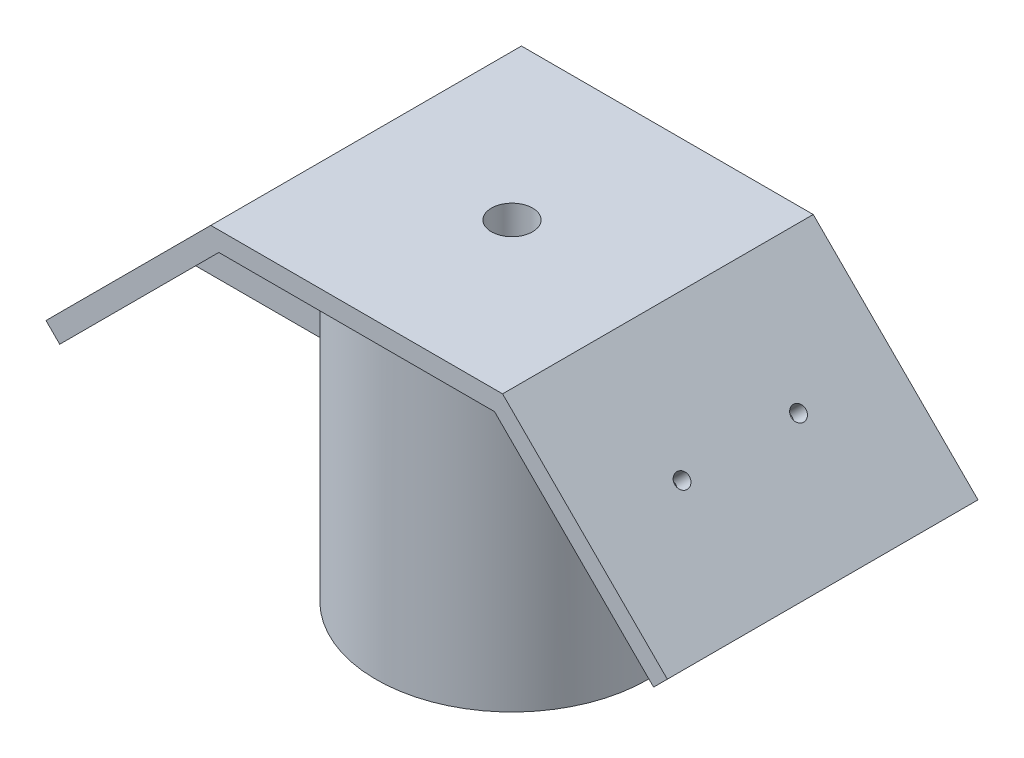
ISO-10303-21;
HEADER;
FILE_DESCRIPTION(('STEP AP214'),'2;1');
FILE_NAME('part.step','',(''),(''),'','','');
FILE_SCHEMA(('AUTOMOTIVE_DESIGN { 1 0 10303 214 1 1 1 1 }'));
ENDSEC;
DATA;
#1=APPLICATION_CONTEXT('core data for automotive mechanical design processes');
#2=APPLICATION_PROTOCOL_DEFINITION('international standard','automotive_design',2000,#1);
#3=PRODUCT_CONTEXT('',#1,'mechanical');
#4=PRODUCT('Part','Part','',(#3));
#5=PRODUCT_RELATED_PRODUCT_CATEGORY('part','',(#4));
#6=PRODUCT_DEFINITION_FORMATION('','',#4);
#7=PRODUCT_DEFINITION_CONTEXT('part definition',#1,'design');
#8=PRODUCT_DEFINITION('design','',#6,#7);
#9=PRODUCT_DEFINITION_SHAPE('','',#8);
#10=(LENGTH_UNIT() NAMED_UNIT(*) SI_UNIT(.MILLI.,.METRE.));
#11=(NAMED_UNIT(*) PLANE_ANGLE_UNIT() SI_UNIT($,.RADIAN.));
#12=(NAMED_UNIT(*) SI_UNIT($,.STERADIAN.) SOLID_ANGLE_UNIT());
#13=UNCERTAINTY_MEASURE_WITH_UNIT(LENGTH_MEASURE(1.E-05),#10,'distance_accuracy_value','');
#14=(GEOMETRIC_REPRESENTATION_CONTEXT(3) GLOBAL_UNCERTAINTY_ASSIGNED_CONTEXT((#13)) GLOBAL_UNIT_ASSIGNED_CONTEXT((#10,
#11,#12)) REPRESENTATION_CONTEXT('',''));
#15=CARTESIAN_POINT('',(0.,0.,0.));
#16=DIRECTION('',(0.,0.,1.));
#17=DIRECTION('',(1.,0.,0.));
#18=AXIS2_PLACEMENT_3D('',#15,#16,#17);
#19=CARTESIAN_POINT('',(0.,38.325640302673,50.8));
#20=DIRECTION('',(0.,-1.,0.));
#21=DIRECTION('',(1.,0.,0.));
#22=AXIS2_PLACEMENT_3D('',#19,#20,#21);
#23=PLANE('',#22);
#24=DIRECTION('',(0.,0.,-1.));
#25=VECTOR('',#24,1.);
#26=CARTESIAN_POINT('',(22.5441035762581,38.3256403026731,50.8));
#27=LINE('',#26,#25);
#28=CARTESIAN_POINT('',(22.5441035762581,38.3256403026731,22.225));
#29=VERTEX_POINT('',#28);
#30=CARTESIAN_POINT('',(22.5441035762581,38.3256403026731,0.));
#31=VERTEX_POINT('',#30);
#32=EDGE_CURVE('E262',#29,#31,#27,.T.);
#33=ORIENTED_EDGE('',*,*,#32,.F.);
#34=DIRECTION('',(1.,0.,0.));
#35=VECTOR('',#34,1.);
#36=CARTESIAN_POINT('',(-500000.,38.3256403023652,22.225));
#37=LINE('',#36,#35);
#38=CARTESIAN_POINT('',(21.9970452561247,38.3256403026731,22.225));
#39=VERTEX_POINT('',#38);
#40=EDGE_CURVE('E182',#39,#29,#37,.T.);
#41=ORIENTED_EDGE('',*,*,#40,.F.);
#42=CARTESIAN_POINT('',(0.,38.3256403026731,25.4));
#43=DIRECTION('',(0.,-1.,0.));
#44=DIRECTION('',(1.,0.,0.));
#45=AXIS2_PLACEMENT_3D('',#42,#43,#44);
#46=CIRCLE('',#45,22.225);
#47=CARTESIAN_POINT('',(-21.9970452561248,38.3256403026731,22.225));
#48=VERTEX_POINT('',#47);
#49=EDGE_CURVE('E11',#48,#39,#46,.T.);
#50=ORIENTED_EDGE('',*,*,#49,.F.);
#51=DIRECTION('',(-1.,0.,0.));
#52=VECTOR('',#51,1.);
#53=CARTESIAN_POINT('',(500000.,38.325640302673,22.225));
#54=LINE('',#53,#52);
#55=CARTESIAN_POINT('',(-22.5441035762581,38.325640302673,22.225));
#56=VERTEX_POINT('',#55);
#57=EDGE_CURVE('E205',#48,#56,#54,.T.);
#58=ORIENTED_EDGE('',*,*,#57,.T.);
#59=DIRECTION('',(0.,0.,-1.));
#60=VECTOR('',#59,1.);
#61=CARTESIAN_POINT('',(-22.5441035762581,38.325640302673,50.8));
#62=LINE('',#61,#60);
#63=CARTESIAN_POINT('',(-22.5441035762581,38.325640302673,0.));
#64=VERTEX_POINT('',#63);
#65=EDGE_CURVE('E266',#56,#64,#62,.T.);
#66=ORIENTED_EDGE('',*,*,#65,.T.);
#67=DIRECTION('',(-1.,0.,0.));
#68=VECTOR('',#67,1.);
#69=CARTESIAN_POINT('',(0.,38.325640302673,0.));
#70=LINE('',#69,#68);
#71=EDGE_CURVE('E254',#31,#64,#70,.T.);
#72=ORIENTED_EDGE('',*,*,#71,.F.);
#73=EDGE_LOOP('',(#33,#41,#50,#58,#66,#72));
#74=FACE_BOUND('',#73,.T.);
#75=ADVANCED_FACE('F37',(#74),#23,.T.);
#76=CARTESIAN_POINT('',(21.9970452561247,38.3256403026731,28.575));
#77=VERTEX_POINT('',#76);
#78=CARTESIAN_POINT('',(-21.9970452561247,38.3256403026731,28.575));
#79=VERTEX_POINT('',#78);
#80=EDGE_CURVE('E45',#77,#79,#46,.T.);
#81=ORIENTED_EDGE('',*,*,#80,.F.);
#82=DIRECTION('',(1.,0.,0.));
#83=VECTOR('',#82,1.);
#84=CARTESIAN_POINT('',(-500000.,38.3256403023652,28.575));
#85=LINE('',#84,#83);
#86=CARTESIAN_POINT('',(22.5441035762581,38.3256403026731,28.575));
#87=VERTEX_POINT('',#86);
#88=EDGE_CURVE('E185',#77,#87,#85,.T.);
#89=ORIENTED_EDGE('',*,*,#88,.T.);
#90=CARTESIAN_POINT('',(22.5441035762581,38.3256403026731,50.8));
#91=VERTEX_POINT('',#90);
#92=EDGE_CURVE('E263',#91,#87,#27,.T.);
#93=ORIENTED_EDGE('',*,*,#92,.F.);
#94=DIRECTION('',(-1.,0.,0.));
#95=VECTOR('',#94,1.);
#96=CARTESIAN_POINT('',(0.,38.325640302673,50.8));
#97=LINE('',#96,#95);
#98=CARTESIAN_POINT('',(-22.5441035762581,38.325640302673,50.8));
#99=VERTEX_POINT('',#98);
#100=EDGE_CURVE('E231',#91,#99,#97,.T.);
#101=ORIENTED_EDGE('',*,*,#100,.T.);
#102=CARTESIAN_POINT('',(-22.5441035762581,38.325640302673,28.575));
#103=VERTEX_POINT('',#102);
#104=EDGE_CURVE('E267',#99,#103,#62,.T.);
#105=ORIENTED_EDGE('',*,*,#104,.T.);
#106=DIRECTION('',(-1.,0.,0.));
#107=VECTOR('',#106,1.);
#108=CARTESIAN_POINT('',(500000.,38.325640302673,28.575));
#109=LINE('',#108,#107);
#110=EDGE_CURVE('E203',#79,#103,#109,.T.);
#111=ORIENTED_EDGE('',*,*,#110,.F.);
#112=EDGE_LOOP('',(#81,#89,#93,#101,#105,#111));
#113=FACE_BOUND('',#112,.T.);
#114=ADVANCED_FACE('F292',(#113),#23,.T.);
#115=CARTESIAN_POINT('',(0.,101.187433150157,25.4));
#116=DIRECTION('',(0.,-1.,0.));
#117=DIRECTION('',(1.,0.,0.));
#118=AXIS2_PLACEMENT_3D('',#115,#116,#117);
#119=CYLINDRICAL_SURFACE('',#118,22.225);
#120=CARTESIAN_POINT('',(0.,-12.474359697327,25.4));
#121=DIRECTION('',(0.,-1.,0.));
#122=DIRECTION('',(1.,0.,0.));
#123=AXIS2_PLACEMENT_3D('',#120,#121,#122);
#124=CIRCLE('',#123,22.225);
#125=CARTESIAN_POINT('',(22.225,-12.4743596973269,25.4));
#126=VERTEX_POINT('',#125);
#127=EDGE_CURVE('E198',#126,#126,#124,.T.);
#128=ORIENTED_EDGE('',*,*,#127,.F.);
#129=EDGE_LOOP('',(#128));
#130=FACE_BOUND('',#129,.T.);
#131=ORIENTED_EDGE('',*,*,#49,.T.);
#132=DIRECTION('',(0.,-1.,0.));
#133=VECTOR('',#132,1.);
#134=CARTESIAN_POINT('',(21.9970452561247,101.187433150157,22.2249999999999));
#135=LINE('',#134,#133);
#136=CARTESIAN_POINT('',(21.9970452561248,12.3148079091982,22.225));
#137=VERTEX_POINT('',#136);
#138=EDGE_CURVE('E161',#137,#39,#135,.F.);
#139=ORIENTED_EDGE('',*,*,#138,.F.);
#140=CARTESIAN_POINT('',(0.,12.3148079091982,25.4));
#141=DIRECTION('',(0.,1.,0.));
#142=DIRECTION('',(-1.,0.,0.));
#143=AXIS2_PLACEMENT_3D('',#140,#141,#142);
#144=CIRCLE('',#143,22.225);
#145=CARTESIAN_POINT('',(21.9970452561142,12.3148079091982,28.575));
#146=VERTEX_POINT('',#145);
#147=EDGE_CURVE('E151',#146,#137,#144,.T.);
#148=ORIENTED_EDGE('',*,*,#147,.F.);
#149=DIRECTION('',(0.,-1.,0.));
#150=VECTOR('',#149,1.);
#151=CARTESIAN_POINT('',(21.9970452561247,101.187433150157,28.575));
#152=LINE('',#151,#150);
#153=EDGE_CURVE('E160',#77,#146,#152,.T.);
#154=ORIENTED_EDGE('',*,*,#153,.F.);
#155=ORIENTED_EDGE('',*,*,#80,.T.);
#156=DIRECTION('',(0.,-1.,0.));
#157=VECTOR('',#156,1.);
#158=CARTESIAN_POINT('',(-21.9970452561248,101.187433150157,28.5750000000001));
#159=LINE('',#158,#157);
#160=CARTESIAN_POINT('',(-21.9970452561247,12.3148079091981,28.575));
#161=VERTEX_POINT('',#160);
#162=EDGE_CURVE('E178',#161,#79,#159,.F.);
#163=ORIENTED_EDGE('',*,*,#162,.F.);
#164=CARTESIAN_POINT('',(0.,12.3148079091981,25.4));
#165=DIRECTION('',(0.,1.,0.));
#166=DIRECTION('',(0.,0.,1.));
#167=AXIS2_PLACEMENT_3D('',#164,#165,#166);
#168=CIRCLE('',#167,22.225);
#169=CARTESIAN_POINT('',(-21.9970452561247,12.3148079091981,22.225));
#170=VERTEX_POINT('',#169);
#171=EDGE_CURVE('E191',#170,#161,#168,.T.);
#172=ORIENTED_EDGE('',*,*,#171,.F.);
#173=DIRECTION('',(0.,-1.,0.));
#174=VECTOR('',#173,1.);
#175=CARTESIAN_POINT('',(-21.9970452561248,101.187433150157,22.225));
#176=LINE('',#175,#174);
#177=EDGE_CURVE('E192',#48,#170,#176,.T.);
#178=ORIENTED_EDGE('',*,*,#177,.F.);
#179=EDGE_LOOP('',(#131,#139,#148,#154,#155,#163,#172,#178));
#180=FACE_BOUND('',#179,.T.);
#181=ADVANCED_FACE('F166',(#130,#180),#119,.T.);
#182=CARTESIAN_POINT('',(30.4348719394657,30.4348719394653,50.8));
#183=DIRECTION('',(0.707106781186552,0.707106781186543,0.));
#184=DIRECTION('',(-0.707106781186543,0.707106781186552,0.));
#185=AXIS2_PLACEMENT_3D('',#182,#183,#184);
#186=PLANE('',#185);
#187=CARTESIAN_POINT('',(35.084551788129,25.7851920908019,15.875));
#188=DIRECTION('',(0.707106781186552,0.707106781186543,0.));
#189=DIRECTION('',(-0.707106781186543,0.707106781186552,0.));
#190=AXIS2_PLACEMENT_3D('',#187,#188,#189);
#191=CIRCLE('',#190,1.190625);
#192=CARTESIAN_POINT('',(34.2426527767788,26.6270911021522,15.875));
#193=VERTEX_POINT('',#192);
#194=EDGE_CURVE('E379',#193,#193,#191,.T.);
#195=ORIENTED_EDGE('',*,*,#194,.T.);
#196=EDGE_LOOP('',(#195));
#197=FACE_BOUND('',#196,.T.);
#198=DIRECTION('',(0.707106781186544,-0.707106781186551,0.));
#199=VECTOR('',#198,1.);
#200=CARTESIAN_POINT('',(48.5549359697327,12.3148079091982,22.225));
#201=LINE('',#200,#199);
#202=CARTESIAN_POINT('',(48.5549359697327,12.3148079091982,22.225));
#203=VERTEX_POINT('',#202);
#204=EDGE_CURVE('E52',#29,#203,#201,.T.);
#205=ORIENTED_EDGE('',*,*,#204,.F.);
#206=ORIENTED_EDGE('',*,*,#32,.T.);
#207=DIRECTION('',(0.707106781186543,-0.707106781186552,0.));
#208=VECTOR('',#207,1.);
#209=CARTESIAN_POINT('',(30.4348719394657,30.4348719394653,0.));
#210=LINE('',#209,#208);
#211=CARTESIAN_POINT('',(48.5549359697327,12.3148079091982,0.));
#212=VERTEX_POINT('',#211);
#213=EDGE_CURVE('E218',#31,#212,#210,.T.);
#214=ORIENTED_EDGE('',*,*,#213,.T.);
#215=DIRECTION('',(0.,0.,-1.));
#216=VECTOR('',#215,1.);
#217=CARTESIAN_POINT('',(48.5549359697327,12.3148079091982,50.8));
#218=LINE('',#217,#216);
#219=EDGE_CURVE('E236',#203,#212,#218,.T.);
#220=ORIENTED_EDGE('',*,*,#219,.F.);
#221=EDGE_LOOP('',(#205,#206,#214,#220));
#222=FACE_BOUND('',#221,.T.);
#223=ADVANCED_FACE('F319',(#197,#222),#186,.F.);
#224=CARTESIAN_POINT('',(35.084551788129,25.7851920908019,34.925));
#225=DIRECTION('',(0.707106781186552,0.707106781186543,0.));
#226=DIRECTION('',(-0.707106781186543,0.707106781186552,0.));
#227=AXIS2_PLACEMENT_3D('',#224,#225,#226);
#228=CIRCLE('',#227,1.190625);
#229=CARTESIAN_POINT('',(34.2426527767788,26.6270911021522,34.925));
#230=VERTEX_POINT('',#229);
#231=EDGE_CURVE('E586',#230,#230,#228,.T.);
#232=ORIENTED_EDGE('',*,*,#231,.T.);
#233=EDGE_LOOP('',(#232));
#234=FACE_BOUND('',#233,.T.);
#235=DIRECTION('',(-0.707106781186544,0.707106781186551,0.));
#236=VECTOR('',#235,1.);
#237=CARTESIAN_POINT('',(48.5549359697327,12.3148079091982,28.575));
#238=LINE('',#237,#236);
#239=CARTESIAN_POINT('',(48.5549359697327,12.3148079091982,28.575));
#240=VERTEX_POINT('',#239);
#241=EDGE_CURVE('E179',#240,#87,#238,.T.);
#242=ORIENTED_EDGE('',*,*,#241,.F.);
#243=CARTESIAN_POINT('',(48.5549359697327,12.3148079091982,50.8));
#244=VERTEX_POINT('',#243);
#245=EDGE_CURVE('E259',#244,#240,#218,.T.);
#246=ORIENTED_EDGE('',*,*,#245,.F.);
#247=DIRECTION('',(0.707106781186543,-0.707106781186552,0.));
#248=VECTOR('',#247,1.);
#249=CARTESIAN_POINT('',(30.4348719394657,30.4348719394653,50.8));
#250=LINE('',#249,#248);
#251=EDGE_CURVE('E234',#91,#244,#250,.T.);
#252=ORIENTED_EDGE('',*,*,#251,.F.);
#253=ORIENTED_EDGE('',*,*,#92,.T.);
#254=EDGE_LOOP('',(#242,#246,#252,#253));
#255=FACE_BOUND('',#254,.T.);
#256=ADVANCED_FACE('F328',(#234,#255),#186,.F.);
#257=CARTESIAN_POINT('',(-30.4348719394657,30.4348719394654,50.8));
#258=DIRECTION('',(0.707106781186551,-0.707106781186543,0.));
#259=DIRECTION('',(0.707106781186544,0.707106781186551,0.));
#260=AXIS2_PLACEMENT_3D('',#257,#258,#259);
#261=PLANE('',#260);
#262=CARTESIAN_POINT('',(-35.084551788129,25.785192090802,34.925));
#263=DIRECTION('',(0.707106781186551,-0.707106781186543,0.));
#264=DIRECTION('',(0.707106781186544,0.707106781186551,0.));
#265=AXIS2_PLACEMENT_3D('',#262,#263,#264);
#266=CIRCLE('',#265,1.190625);
#267=CARTESIAN_POINT('',(-35.9264507994793,24.9432930794517,34.925));
#268=VERTEX_POINT('',#267);
#269=EDGE_CURVE('E376',#268,#268,#266,.F.);
#270=ORIENTED_EDGE('',*,*,#269,.T.);
#271=EDGE_LOOP('',(#270));
#272=FACE_BOUND('',#271,.T.);
#273=DIRECTION('',(0.,0.,-1.));
#274=VECTOR('',#273,1.);
#275=CARTESIAN_POINT('',(-48.5549359697327,12.3148079091982,50.8));
#276=LINE('',#275,#274);
#277=CARTESIAN_POINT('',(-48.5549359697327,12.3148079091982,50.8));
#278=VERTEX_POINT('',#277);
#279=CARTESIAN_POINT('',(-48.5549359697327,12.3148079091982,28.575));
#280=VERTEX_POINT('',#279);
#281=EDGE_CURVE('E271',#278,#280,#276,.T.);
#282=ORIENTED_EDGE('',*,*,#281,.T.);
#283=DIRECTION('',(-0.707106781186544,-0.707106781186551,0.));
#284=VECTOR('',#283,1.);
#285=CARTESIAN_POINT('',(-48.5549359697327,12.3148079091982,28.575));
#286=LINE('',#285,#284);
#287=EDGE_CURVE('E195',#103,#280,#286,.T.);
#288=ORIENTED_EDGE('',*,*,#287,.F.);
#289=ORIENTED_EDGE('',*,*,#104,.F.);
#290=DIRECTION('',(-0.707106781186544,-0.707106781186551,0.));
#291=VECTOR('',#290,1.);
#292=CARTESIAN_POINT('',(-30.4348719394657,30.4348719394654,50.8));
#293=LINE('',#292,#291);
#294=EDGE_CURVE('E228',#99,#278,#293,.T.);
#295=ORIENTED_EDGE('',*,*,#294,.T.);
#296=EDGE_LOOP('',(#282,#288,#289,#295));
#297=FACE_BOUND('',#296,.T.);
#298=ADVANCED_FACE('F296',(#272,#297),#261,.T.);
#299=CARTESIAN_POINT('',(-35.084551788129,25.785192090802,15.875));
#300=DIRECTION('',(0.707106781186551,-0.707106781186543,0.));
#301=DIRECTION('',(0.707106781186544,0.707106781186551,0.));
#302=AXIS2_PLACEMENT_3D('',#299,#300,#301);
#303=CIRCLE('',#302,1.190625);
#304=CARTESIAN_POINT('',(-35.9264507994793,24.9432930794517,15.875));
#305=VERTEX_POINT('',#304);
#306=EDGE_CURVE('E382',#305,#305,#303,.F.);
#307=ORIENTED_EDGE('',*,*,#306,.T.);
#308=EDGE_LOOP('',(#307));
#309=FACE_BOUND('',#308,.T.);
#310=ORIENTED_EDGE('',*,*,#65,.F.);
#311=DIRECTION('',(0.707106781186544,0.707106781186551,0.));
#312=VECTOR('',#311,1.);
#313=CARTESIAN_POINT('',(-48.5549359697327,12.3148079091982,22.225));
#314=LINE('',#313,#312);
#315=CARTESIAN_POINT('',(-48.5549359697327,12.3148079091982,22.225));
#316=VERTEX_POINT('',#315);
#317=EDGE_CURVE('E199',#316,#56,#314,.T.);
#318=ORIENTED_EDGE('',*,*,#317,.F.);
#319=CARTESIAN_POINT('',(-48.5549359697327,12.3148079091982,0.));
#320=VERTEX_POINT('',#319);
#321=EDGE_CURVE('E270',#316,#320,#276,.T.);
#322=ORIENTED_EDGE('',*,*,#321,.T.);
#323=DIRECTION('',(-0.707106781186544,-0.707106781186551,0.));
#324=VECTOR('',#323,1.);
#325=CARTESIAN_POINT('',(-30.4348719394657,30.4348719394654,0.));
#326=LINE('',#325,#324);
#327=EDGE_CURVE('E251',#64,#320,#326,.T.);
#328=ORIENTED_EDGE('',*,*,#327,.F.);
#329=EDGE_LOOP('',(#310,#318,#322,#328));
#330=FACE_BOUND('',#329,.T.);
#331=ADVANCED_FACE('F311',(#309,#330),#261,.T.);
#332=CARTESIAN_POINT('',(18.1200640302669,-18.1200640302672,50.8));
#333=DIRECTION('',(-0.707106781186542,0.707106781186552,0.));
#334=DIRECTION('',(-0.707106781186552,-0.707106781186543,0.));
#335=AXIS2_PLACEMENT_3D('',#332,#333,#334);
#336=PLANE('',#335);
#337=DIRECTION('',(0.707106781186552,0.707106781186543,0.));
#338=VECTOR('',#337,1.);
#339=CARTESIAN_POINT('',(18.1200640302669,-18.1200640302672,0.));
#340=LINE('',#339,#338);
#341=CARTESIAN_POINT('',(50.8,14.5598719394654,0.));
#342=VERTEX_POINT('',#341);
#343=EDGE_CURVE('E213',#212,#342,#340,.T.);
#344=ORIENTED_EDGE('',*,*,#343,.T.);
#345=DIRECTION('',(0.,0.,-1.));
#346=VECTOR('',#345,1.);
#347=CARTESIAN_POINT('',(50.8,14.5598719394654,50.8));
#348=LINE('',#347,#346);
#349=CARTESIAN_POINT('',(50.8,14.5598719394654,50.8));
#350=VERTEX_POINT('',#349);
#351=EDGE_CURVE('E279',#350,#342,#348,.T.);
#352=ORIENTED_EDGE('',*,*,#351,.F.);
#353=DIRECTION('',(0.707106781186552,0.707106781186543,0.));
#354=VECTOR('',#353,1.);
#355=CARTESIAN_POINT('',(18.1200640302669,-18.1200640302672,50.8));
#356=LINE('',#355,#354);
#357=EDGE_CURVE('E214',#244,#350,#356,.T.);
#358=ORIENTED_EDGE('',*,*,#357,.F.);
#359=ORIENTED_EDGE('',*,*,#245,.T.);
#360=DIRECTION('',(0.,0.,1.));
#361=VECTOR('',#360,1.);
#362=CARTESIAN_POINT('',(48.5549359697327,12.3148079091982,22.225));
#363=LINE('',#362,#361);
#364=EDGE_CURVE('E181',#203,#240,#363,.T.);
#365=ORIENTED_EDGE('',*,*,#364,.F.);
#366=ORIENTED_EDGE('',*,*,#219,.T.);
#367=EDGE_LOOP('',(#344,#352,#358,#359,#365,#366));
#368=FACE_BOUND('',#367,.T.);
#369=ADVANCED_FACE('F39',(#368),#336,.F.);
#370=CARTESIAN_POINT('',(32.679935969733,32.6799359697326,50.8));
#371=DIRECTION('',(-0.707106781186552,-0.707106781186543,0.));
#372=DIRECTION('',(0.707106781186543,-0.707106781186552,0.));
#373=AXIS2_PLACEMENT_3D('',#370,#371,#372);
#374=PLANE('',#373);
#375=CARTESIAN_POINT('',(37.3296158183963,28.0302561210692,34.925));
#376=DIRECTION('',(-0.707106781186552,-0.707106781186543,0.));
#377=DIRECTION('',(-0.707106781186543,0.707106781186552,0.));
#378=AXIS2_PLACEMENT_3D('',#375,#376,#377);
#379=CIRCLE('',#378,1.190625);
#380=CARTESIAN_POINT('',(36.4877168070461,28.8721551324195,34.925));
#381=VERTEX_POINT('',#380);
#382=EDGE_CURVE('E583',#381,#381,#379,.T.);
#383=ORIENTED_EDGE('',*,*,#382,.T.);
#384=EDGE_LOOP('',(#383));
#385=FACE_BOUND('',#384,.T.);
#386=CARTESIAN_POINT('',(37.3296158183963,28.0302561210692,15.875));
#387=DIRECTION('',(-0.707106781186552,-0.707106781186543,0.));
#388=DIRECTION('',(0.707106781186543,-0.707106781186552,0.));
#389=AXIS2_PLACEMENT_3D('',#386,#387,#388);
#390=CIRCLE('',#389,1.190625);
#391=CARTESIAN_POINT('',(38.1715148297466,27.188357109719,15.875));
#392=VERTEX_POINT('',#391);
#393=EDGE_CURVE('E385',#392,#392,#390,.T.);
#394=ORIENTED_EDGE('',*,*,#393,.T.);
#395=EDGE_LOOP('',(#394));
#396=FACE_BOUND('',#395,.T.);
#397=DIRECTION('',(-0.707106781186543,0.707106781186552,0.));
#398=VECTOR('',#397,1.);
#399=CARTESIAN_POINT('',(32.679935969733,32.6799359697326,0.));
#400=LINE('',#399,#398);
#401=CARTESIAN_POINT('',(23.8592316367927,41.500640302673,0.));
#402=VERTEX_POINT('',#401);
#403=EDGE_CURVE('E239',#342,#402,#400,.T.);
#404=ORIENTED_EDGE('',*,*,#403,.T.);
#405=DIRECTION('',(0.,0.,-1.));
#406=VECTOR('',#405,1.);
#407=CARTESIAN_POINT('',(23.8592316367927,41.500640302673,50.8));
#408=LINE('',#407,#406);
#409=CARTESIAN_POINT('',(23.8592316367927,41.500640302673,50.8));
#410=VERTEX_POINT('',#409);
#411=EDGE_CURVE('E278',#410,#402,#408,.T.);
#412=ORIENTED_EDGE('',*,*,#411,.F.);
#413=DIRECTION('',(-0.707106781186543,0.707106781186552,0.));
#414=VECTOR('',#413,1.);
#415=CARTESIAN_POINT('',(32.679935969733,32.6799359697326,50.8));
#416=LINE('',#415,#414);
#417=EDGE_CURVE('E217',#350,#410,#416,.T.);
#418=ORIENTED_EDGE('',*,*,#417,.F.);
#419=ORIENTED_EDGE('',*,*,#351,.T.);
#420=EDGE_LOOP('',(#404,#412,#418,#419));
#421=FACE_BOUND('',#420,.T.);
#422=ADVANCED_FACE('F336',(#385,#396,#421),#374,.F.);
#423=CARTESIAN_POINT('',(0.,41.500640302673,50.8));
#424=DIRECTION('',(0.,1.,0.));
#425=DIRECTION('',(-1.,0.,0.));
#426=AXIS2_PLACEMENT_3D('',#423,#424,#425);
#427=PLANE('',#426);
#428=CARTESIAN_POINT('',(0.,41.500640302673,25.4));
#429=DIRECTION('',(0.,1.,0.));
#430=DIRECTION('',(-1.,0.,0.));
#431=AXIS2_PLACEMENT_3D('',#428,#429,#430);
#432=CIRCLE('',#431,3.3655);
#433=CARTESIAN_POINT('',(-3.3655,41.500640302673,25.4));
#434=VERTEX_POINT('',#433);
#435=EDGE_CURVE('E172',#434,#434,#432,.T.);
#436=ORIENTED_EDGE('',*,*,#435,.F.);
#437=EDGE_LOOP('',(#436));
#438=FACE_BOUND('',#437,.T.);
#439=DIRECTION('',(1.,0.,0.));
#440=VECTOR('',#439,1.);
#441=CARTESIAN_POINT('',(0.,41.500640302673,0.));
#442=LINE('',#441,#440);
#443=CARTESIAN_POINT('',(-23.8592316367927,41.500640302673,0.));
#444=VERTEX_POINT('',#443);
#445=EDGE_CURVE('E242',#444,#402,#442,.T.);
#446=ORIENTED_EDGE('',*,*,#445,.F.);
#447=DIRECTION('',(0.,0.,-1.));
#448=VECTOR('',#447,1.);
#449=CARTESIAN_POINT('',(-23.8592316367927,41.500640302673,50.8));
#450=LINE('',#449,#448);
#451=CARTESIAN_POINT('',(-23.8592316367927,41.500640302673,50.8));
#452=VERTEX_POINT('',#451);
#453=EDGE_CURVE('E276',#452,#444,#450,.T.);
#454=ORIENTED_EDGE('',*,*,#453,.F.);
#455=DIRECTION('',(1.,0.,0.));
#456=VECTOR('',#455,1.);
#457=CARTESIAN_POINT('',(0.,41.500640302673,50.8));
#458=LINE('',#457,#456);
#459=EDGE_CURVE('E220',#452,#410,#458,.T.);
#460=ORIENTED_EDGE('',*,*,#459,.T.);
#461=ORIENTED_EDGE('',*,*,#411,.T.);
#462=EDGE_LOOP('',(#446,#454,#460,#461));
#463=FACE_BOUND('',#462,.T.);
#464=ADVANCED_FACE('F338',(#438,#463),#427,.T.);
#465=CARTESIAN_POINT('',(-32.679935969733,32.6799359697326,50.8));
#466=DIRECTION('',(-0.707106781186552,0.707106781186543,0.));
#467=DIRECTION('',(-0.707106781186543,-0.707106781186552,0.));
#468=AXIS2_PLACEMENT_3D('',#465,#466,#467);
#469=PLANE('',#468);
#470=CARTESIAN_POINT('',(-37.3296158183963,28.0302561210692,34.925));
#471=DIRECTION('',(-0.707106781186552,0.707106781186543,0.));
#472=DIRECTION('',(0.707106781186543,0.707106781186552,0.));
#473=AXIS2_PLACEMENT_3D('',#470,#471,#472);
#474=CIRCLE('',#473,1.190625);
#475=CARTESIAN_POINT('',(-38.1715148297466,27.188357109719,34.925));
#476=VERTEX_POINT('',#475);
#477=EDGE_CURVE('E378',#476,#476,#474,.T.);
#478=ORIENTED_EDGE('',*,*,#477,.F.);
#479=EDGE_LOOP('',(#478));
#480=FACE_BOUND('',#479,.T.);
#481=CARTESIAN_POINT('',(-37.3296158183963,28.0302561210692,15.875));
#482=DIRECTION('',(-0.707106781186552,0.707106781186543,0.));
#483=DIRECTION('',(-0.707106781186543,-0.707106781186552,0.));
#484=AXIS2_PLACEMENT_3D('',#481,#482,#483);
#485=CIRCLE('',#484,1.190625);
#486=CARTESIAN_POINT('',(-38.1715148297466,27.188357109719,15.875));
#487=VERTEX_POINT('',#486);
#488=EDGE_CURVE('E391',#487,#487,#485,.T.);
#489=ORIENTED_EDGE('',*,*,#488,.F.);
#490=EDGE_LOOP('',(#489));
#491=FACE_BOUND('',#490,.T.);
#492=DIRECTION('',(0.707106781186543,0.707106781186552,0.));
#493=VECTOR('',#492,1.);
#494=CARTESIAN_POINT('',(-32.679935969733,32.6799359697326,0.));
#495=LINE('',#494,#493);
#496=CARTESIAN_POINT('',(-50.8,14.5598719394654,0.));
#497=VERTEX_POINT('',#496);
#498=EDGE_CURVE('E245',#497,#444,#495,.T.);
#499=ORIENTED_EDGE('',*,*,#498,.F.);
#500=DIRECTION('',(0.,0.,-1.));
#501=VECTOR('',#500,1.);
#502=CARTESIAN_POINT('',(-50.8,14.5598719394654,50.8));
#503=LINE('',#502,#501);
#504=CARTESIAN_POINT('',(-50.8,14.5598719394654,50.8));
#505=VERTEX_POINT('',#504);
#506=EDGE_CURVE('E274',#505,#497,#503,.T.);
#507=ORIENTED_EDGE('',*,*,#506,.F.);
#508=DIRECTION('',(0.707106781186543,0.707106781186552,0.));
#509=VECTOR('',#508,1.);
#510=CARTESIAN_POINT('',(-32.679935969733,32.6799359697326,50.8));
#511=LINE('',#510,#509);
#512=EDGE_CURVE('E223',#505,#452,#511,.T.);
#513=ORIENTED_EDGE('',*,*,#512,.T.);
#514=ORIENTED_EDGE('',*,*,#453,.T.);
#515=EDGE_LOOP('',(#499,#507,#513,#514));
#516=FACE_BOUND('',#515,.T.);
#517=ADVANCED_FACE('F341',(#480,#491,#516),#469,.T.);
#518=CARTESIAN_POINT('',(-18.120064030267,-18.1200640302672,50.8));
#519=DIRECTION('',(0.707106781186544,0.707106781186551,0.));
#520=DIRECTION('',(-0.707106781186551,0.707106781186544,0.));
#521=AXIS2_PLACEMENT_3D('',#518,#519,#520);
#522=PLANE('',#521);
#523=DIRECTION('',(0.707106781186551,-0.707106781186544,0.));
#524=VECTOR('',#523,1.);
#525=CARTESIAN_POINT('',(-18.120064030267,-18.1200640302672,0.));
#526=LINE('',#525,#524);
#527=EDGE_CURVE('E248',#497,#320,#526,.T.);
#528=ORIENTED_EDGE('',*,*,#527,.T.);
#529=ORIENTED_EDGE('',*,*,#321,.F.);
#530=DIRECTION('',(0.,0.,-1.));
#531=VECTOR('',#530,1.);
#532=CARTESIAN_POINT('',(-48.5549359697327,12.3148079091982,28.575));
#533=LINE('',#532,#531);
#534=EDGE_CURVE('E201',#280,#316,#533,.T.);
#535=ORIENTED_EDGE('',*,*,#534,.F.);
#536=ORIENTED_EDGE('',*,*,#281,.F.);
#537=DIRECTION('',(0.707106781186551,-0.707106781186544,0.));
#538=VECTOR('',#537,1.);
#539=CARTESIAN_POINT('',(-18.120064030267,-18.1200640302672,50.8));
#540=LINE('',#539,#538);
#541=EDGE_CURVE('E226',#505,#278,#540,.T.);
#542=ORIENTED_EDGE('',*,*,#541,.F.);
#543=ORIENTED_EDGE('',*,*,#506,.T.);
#544=EDGE_LOOP('',(#528,#529,#535,#536,#542,#543));
#545=FACE_BOUND('',#544,.T.);
#546=ADVANCED_FACE('F305',(#545),#522,.F.);
#547=CARTESIAN_POINT('',(0.,0.,50.8));
#548=DIRECTION('',(0.,0.,1.));
#549=DIRECTION('',(1.,0.,0.));
#550=AXIS2_PLACEMENT_3D('',#547,#548,#549);
#551=PLANE('',#550);
#552=ORIENTED_EDGE('',*,*,#357,.T.);
#553=ORIENTED_EDGE('',*,*,#417,.T.);
#554=ORIENTED_EDGE('',*,*,#459,.F.);
#555=ORIENTED_EDGE('',*,*,#512,.F.);
#556=ORIENTED_EDGE('',*,*,#541,.T.);
#557=ORIENTED_EDGE('',*,*,#294,.F.);
#558=ORIENTED_EDGE('',*,*,#100,.F.);
#559=ORIENTED_EDGE('',*,*,#251,.T.);
#560=EDGE_LOOP('',(#552,#553,#554,#555,#556,#557,#558,#559));
#561=FACE_BOUND('',#560,.T.);
#562=ADVANCED_FACE('F298',(#561),#551,.T.);
#563=CARTESIAN_POINT('',(0.,0.,0.));
#564=DIRECTION('',(0.,0.,1.));
#565=DIRECTION('',(1.,0.,0.));
#566=AXIS2_PLACEMENT_3D('',#563,#564,#565);
#567=PLANE('',#566);
#568=ORIENTED_EDGE('',*,*,#343,.F.);
#569=ORIENTED_EDGE('',*,*,#213,.F.);
#570=ORIENTED_EDGE('',*,*,#71,.T.);
#571=ORIENTED_EDGE('',*,*,#327,.T.);
#572=ORIENTED_EDGE('',*,*,#527,.F.);
#573=ORIENTED_EDGE('',*,*,#498,.T.);
#574=ORIENTED_EDGE('',*,*,#445,.T.);
#575=ORIENTED_EDGE('',*,*,#403,.F.);
#576=EDGE_LOOP('',(#568,#569,#570,#571,#572,#573,#574,#575));
#577=FACE_BOUND('',#576,.T.);
#578=ADVANCED_FACE('F334',(#577),#567,.F.);
#579=CARTESIAN_POINT('',(0.,-12.474359697327,25.4));
#580=DIRECTION('',(0.,-1.,0.));
#581=DIRECTION('',(1.,0.,0.));
#582=AXIS2_PLACEMENT_3D('',#579,#580,#581);
#583=PLANE('',#582);
#584=CARTESIAN_POINT('',(0.,-12.474359697327,25.4));
#585=DIRECTION('',(0.,1.,0.));
#586=DIRECTION('',(-1.,0.,0.));
#587=AXIS2_PLACEMENT_3D('',#584,#585,#586);
#588=CIRCLE('',#587,3.3655);
#589=CARTESIAN_POINT('',(-3.36549999999999,-12.474359697327,25.4));
#590=VERTEX_POINT('',#589);
#591=EDGE_CURVE('E169',#590,#590,#588,.T.);
#592=ORIENTED_EDGE('',*,*,#591,.T.);
#593=EDGE_LOOP('',(#592));
#594=FACE_BOUND('',#593,.T.);
#595=ORIENTED_EDGE('',*,*,#127,.T.);
#596=EDGE_LOOP('',(#595));
#597=FACE_BOUND('',#596,.T.);
#598=ADVANCED_FACE('F419',(#594,#597),#583,.T.);
#599=CARTESIAN_POINT('',(499973.989167607,12.3148079091982,28.575));
#600=DIRECTION('',(0.,0.,-1.));
#601=DIRECTION('',(0.,1.,0.));
#602=AXIS2_PLACEMENT_3D('',#599,#600,#601);
#603=PLANE('',#602);
#604=DIRECTION('',(-1.,0.,0.));
#605=VECTOR('',#604,1.);
#606=CARTESIAN_POINT('',(499973.989167607,12.3148079091982,28.575));
#607=LINE('',#606,#605);
#608=EDGE_CURVE('E194',#161,#280,#607,.T.);
#609=ORIENTED_EDGE('',*,*,#608,.F.);
#610=ORIENTED_EDGE('',*,*,#162,.T.);
#611=ORIENTED_EDGE('',*,*,#110,.T.);
#612=ORIENTED_EDGE('',*,*,#287,.T.);
#613=EDGE_LOOP('',(#609,#610,#611,#612));
#614=FACE_BOUND('',#613,.T.);
#615=ADVANCED_FACE('F290',(#614),#603,.F.);
#616=CARTESIAN_POINT('',(499973.989167607,12.3148079091982,22.225));
#617=DIRECTION('',(0.,0.,1.));
#618=DIRECTION('',(1.,0.,0.));
#619=AXIS2_PLACEMENT_3D('',#616,#617,#618);
#620=PLANE('',#619);
#621=ORIENTED_EDGE('',*,*,#57,.F.);
#622=ORIENTED_EDGE('',*,*,#177,.T.);
#623=DIRECTION('',(-1.,0.,0.));
#624=VECTOR('',#623,1.);
#625=CARTESIAN_POINT('',(499973.989167607,12.3148079091982,22.225));
#626=LINE('',#625,#624);
#627=EDGE_CURVE('E60',#170,#316,#626,.T.);
#628=ORIENTED_EDGE('',*,*,#627,.T.);
#629=ORIENTED_EDGE('',*,*,#317,.T.);
#630=EDGE_LOOP('',(#621,#622,#628,#629));
#631=FACE_BOUND('',#630,.T.);
#632=ADVANCED_FACE('F314',(#631),#620,.F.);
#633=CARTESIAN_POINT('',(499973.989167607,12.3148079091982,28.575));
#634=DIRECTION('',(0.,1.,0.));
#635=DIRECTION('',(0.,0.,1.));
#636=AXIS2_PLACEMENT_3D('',#633,#634,#635);
#637=PLANE('',#636);
#638=ORIENTED_EDGE('',*,*,#627,.F.);
#639=ORIENTED_EDGE('',*,*,#171,.T.);
#640=ORIENTED_EDGE('',*,*,#608,.T.);
#641=ORIENTED_EDGE('',*,*,#534,.T.);
#642=EDGE_LOOP('',(#638,#639,#640,#641));
#643=FACE_BOUND('',#642,.T.);
#644=ADVANCED_FACE('F308',(#643),#637,.F.);
#645=CARTESIAN_POINT('',(-499973.989167607,12.3148079088904,22.225));
#646=DIRECTION('',(0.,0.,1.));
#647=DIRECTION('',(0.,-1.,0.));
#648=AXIS2_PLACEMENT_3D('',#645,#646,#647);
#649=PLANE('',#648);
#650=DIRECTION('',(1.,0.,0.));
#651=VECTOR('',#650,1.);
#652=CARTESIAN_POINT('',(-499973.989167607,12.3148079088904,22.225));
#653=LINE('',#652,#651);
#654=EDGE_CURVE('E154',#137,#203,#653,.T.);
#655=ORIENTED_EDGE('',*,*,#654,.F.);
#656=ORIENTED_EDGE('',*,*,#138,.T.);
#657=ORIENTED_EDGE('',*,*,#40,.T.);
#658=ORIENTED_EDGE('',*,*,#204,.T.);
#659=EDGE_LOOP('',(#655,#656,#657,#658));
#660=FACE_BOUND('',#659,.T.);
#661=ADVANCED_FACE('F163',(#660),#649,.F.);
#662=CARTESIAN_POINT('',(-499973.989167607,12.3148079088904,28.575));
#663=DIRECTION('',(0.,0.,-1.));
#664=DIRECTION('',(-1.,0.,0.));
#665=AXIS2_PLACEMENT_3D('',#662,#663,#664);
#666=PLANE('',#665);
#667=ORIENTED_EDGE('',*,*,#88,.F.);
#668=ORIENTED_EDGE('',*,*,#153,.T.);
#669=DIRECTION('',(1.,0.,0.));
#670=VECTOR('',#669,1.);
#671=CARTESIAN_POINT('',(-499973.989167607,12.3148079088904,28.575));
#672=LINE('',#671,#670);
#673=EDGE_CURVE('E156',#146,#240,#672,.T.);
#674=ORIENTED_EDGE('',*,*,#673,.T.);
#675=ORIENTED_EDGE('',*,*,#241,.T.);
#676=EDGE_LOOP('',(#667,#668,#674,#675));
#677=FACE_BOUND('',#676,.T.);
#678=ADVANCED_FACE('F331',(#677),#666,.F.);
#679=CARTESIAN_POINT('',(-499973.989167607,12.3148079088904,22.225));
#680=DIRECTION('',(0.,1.,0.));
#681=DIRECTION('',(-1.,0.,0.));
#682=AXIS2_PLACEMENT_3D('',#679,#680,#681);
#683=PLANE('',#682);
#684=ORIENTED_EDGE('',*,*,#673,.F.);
#685=ORIENTED_EDGE('',*,*,#147,.T.);
#686=ORIENTED_EDGE('',*,*,#654,.T.);
#687=ORIENTED_EDGE('',*,*,#364,.T.);
#688=EDGE_LOOP('',(#684,#685,#686,#687));
#689=FACE_BOUND('',#688,.T.);
#690=ADVANCED_FACE('F152',(#689),#683,.F.);
#691=CARTESIAN_POINT('',(0.,-12.474359697327,25.4));
#692=DIRECTION('',(0.,1.,0.));
#693=DIRECTION('',(-1.,0.,0.));
#694=AXIS2_PLACEMENT_3D('',#691,#692,#693);
#695=CYLINDRICAL_SURFACE('',#694,3.3655);
#696=ORIENTED_EDGE('',*,*,#591,.F.);
#697=EDGE_LOOP('',(#696));
#698=FACE_BOUND('',#697,.T.);
#699=ORIENTED_EDGE('',*,*,#435,.T.);
#700=EDGE_LOOP('',(#699));
#701=FACE_BOUND('',#700,.T.);
#702=ADVANCED_FACE('F398',(#698,#701),#695,.F.);
#703=CARTESIAN_POINT('',(26.9885000000004,-36.2878596973268,15.875));
#704=DIRECTION('',(-0.707106781186552,0.707106781186543,0.));
#705=DIRECTION('',(-0.707106781186543,-0.707106781186552,0.));
#706=AXIS2_PLACEMENT_3D('',#703,#704,#705);
#707=CYLINDRICAL_SURFACE('',#706,1.190625);
#708=CARTESIAN_POINT('',(-35.9264507994793,24.9432930794517,15.875));
#709=CARTESIAN_POINT('',(-35.9498368831279,24.9666791631003,15.875));
#710=CARTESIAN_POINT('',(-35.9732229667765,24.990065246749,15.875));
#711=CARTESIAN_POINT('',(-36.0199951340738,25.0368374140462,15.875));
#712=CARTESIAN_POINT('',(-36.0433812177224,25.0602234976948,15.875));
#713=CARTESIAN_POINT('',(-36.0901533850196,25.1069956649921,15.875));
#714=CARTESIAN_POINT('',(-36.1135394686682,25.1303817486407,15.875));
#715=CARTESIAN_POINT('',(-36.1603116359655,25.1771539159379,15.875));
#716=CARTESIAN_POINT('',(-36.1836977196141,25.2005399995865,15.875));
#717=CARTESIAN_POINT('',(-36.2304698869113,25.2473121668837,15.875));
#718=CARTESIAN_POINT('',(-36.2538559705599,25.2706982505324,15.875));
#719=CARTESIAN_POINT('',(-36.3006281378572,25.3174704178296,15.875));
#720=CARTESIAN_POINT('',(-36.3240142215058,25.3408565014782,15.875));
#721=CARTESIAN_POINT('',(-36.370786388803,25.3876286687755,15.875));
#722=CARTESIAN_POINT('',(-36.3941724724516,25.4110147524241,15.875));
#723=CARTESIAN_POINT('',(-36.4409446397489,25.4577869197213,15.875));
#724=CARTESIAN_POINT('',(-36.4643307233975,25.4811730033699,15.875));
#725=CARTESIAN_POINT('',(-36.5111028906947,25.5279451706672,15.875));
#726=CARTESIAN_POINT('',(-36.5344889743433,25.5513312543158,15.875));
#727=CARTESIAN_POINT('',(-36.5812611416406,25.598103421613,15.875));
#728=CARTESIAN_POINT('',(-36.6046472252892,25.6214895052616,15.875));
#729=CARTESIAN_POINT('',(-36.6514193925864,25.6682616725589,15.875));
#730=CARTESIAN_POINT('',(-36.6748054762351,25.6916477562075,15.875));
#731=CARTESIAN_POINT('',(-36.7215776435323,25.7384199235047,15.875));
#732=CARTESIAN_POINT('',(-36.7449637271809,25.7618060071533,15.875));
#733=CARTESIAN_POINT('',(-36.7917358944781,25.8085781744506,15.875));
#734=CARTESIAN_POINT('',(-36.8151219781268,25.8319642580992,15.875));
#735=CARTESIAN_POINT('',(-36.861894145424,25.8787364253964,15.875));
#736=CARTESIAN_POINT('',(-36.8852802290726,25.902122509045,15.875));
#737=CARTESIAN_POINT('',(-36.9320523963698,25.9488946763423,15.875));
#738=CARTESIAN_POINT('',(-36.9554384800185,25.9722807599909,15.875));
#739=CARTESIAN_POINT('',(-37.0022106473157,26.0190529272881,15.875));
#740=CARTESIAN_POINT('',(-37.0255967309643,26.0424390109367,15.875));
#741=CARTESIAN_POINT('',(-37.0723688982616,26.089211178234,15.875));
#742=CARTESIAN_POINT('',(-37.0957549819102,26.1125972618826,15.875));
#743=CARTESIAN_POINT('',(-37.1425271492074,26.1593694291798,15.875));
#744=CARTESIAN_POINT('',(-37.165913232856,26.1827555128284,15.875));
#745=CARTESIAN_POINT('',(-37.2126854001533,26.2295276801257,15.875));
#746=CARTESIAN_POINT('',(-37.2360714838019,26.2529137637743,15.875));
#747=CARTESIAN_POINT('',(-37.2828436510991,26.2996859310715,15.875));
#748=CARTESIAN_POINT('',(-37.3062297347477,26.3230720147202,15.875));
#749=CARTESIAN_POINT('',(-37.353001902045,26.3698441820174,15.875));
#750=CARTESIAN_POINT('',(-37.3763879856936,26.393230265666,15.875));
#751=CARTESIAN_POINT('',(-37.4231601529908,26.4400024329632,15.875));
#752=CARTESIAN_POINT('',(-37.4465462366394,26.4633885166119,15.875));
#753=CARTESIAN_POINT('',(-37.4933184039367,26.5101606839091,15.875));
#754=CARTESIAN_POINT('',(-37.5167044875853,26.5335467675577,15.875));
#755=CARTESIAN_POINT('',(-37.5634766548825,26.5803189348549,15.875));
#756=CARTESIAN_POINT('',(-37.5868627385311,26.6037050185036,15.875));
#757=CARTESIAN_POINT('',(-37.6336349058284,26.6504771858008,15.875));
#758=CARTESIAN_POINT('',(-37.657020989477,26.6738632694494,15.875));
#759=CARTESIAN_POINT('',(-37.7037931567742,26.7206354367466,15.875));
#760=CARTESIAN_POINT('',(-37.7271792404228,26.7440215203953,15.875));
#761=CARTESIAN_POINT('',(-37.7739514077201,26.7907936876925,15.875));
#762=CARTESIAN_POINT('',(-37.7973374913687,26.8141797713411,15.875));
#763=CARTESIAN_POINT('',(-37.8441096586659,26.8609519386383,15.875));
#764=CARTESIAN_POINT('',(-37.8674957423146,26.884338022287,15.875));
#765=CARTESIAN_POINT('',(-37.9142679096118,26.9311101895842,15.875));
#766=CARTESIAN_POINT('',(-37.9376539932604,26.9544962732328,15.875));
#767=CARTESIAN_POINT('',(-37.9844261605576,27.00126844053,15.875));
#768=CARTESIAN_POINT('',(-38.0078122442063,27.0246545241787,15.875));
#769=CARTESIAN_POINT('',(-38.0545844115035,27.0714266914759,15.875));
#770=CARTESIAN_POINT('',(-38.0779704951521,27.0948127751245,15.875));
#771=CARTESIAN_POINT('',(-38.1247426624493,27.1415849424218,15.875));
#772=CARTESIAN_POINT('',(-38.148128746098,27.1649710260704,15.875));
#773=CARTESIAN_POINT('',(-38.1715148297466,27.188357109719,15.875));
#774=B_SPLINE_CURVE_WITH_KNOTS('',3,(#708,#709,#710,#711,#712,#713,#714,#715,#716,#717,#718,
#719,#720,#721,#722,#723,#724,#725,#726,#727,#728,#729,#730,#731,#732,#733,#734,#735,#736,#737,
#738,#739,#740,#741,#742,#743,#744,#745,#746,#747,#748,#749,#750,#751,#752,#753,#754,#755,#756,
#757,#758,#759,#760,#761,#762,#763,#764,#765,#766,#767,#768,#769,#770,#771,#772,#773),
.UNSPECIFIED.,.F.,.F.,(4,2,2,2,2,2,2,2,2,2,2,2,2,2,2,2,2,2,2,2,2,2,2,2,2,2,2,2,2,2,2,2,4),(0.,
0.0992187500000033,0.198437499999997,0.29765625,0.396874999999989,0.496093749999992,
0.595312499999995,0.694531249999984,0.793749999999997,0.89296875,0.992187499999994,1.09140625,
1.190625,1.28984374999999,1.38906249999999,1.48828124999998,1.58749999999999,1.68671874999999,
1.78593749999998,1.88515624999999,1.98437499999999,2.08359374999998,2.18281249999999,
2.28203124999998,2.38124999999998,2.48046874999999,2.57968749999998,2.67890624999999,
2.77812499999998,2.87734374999998,2.97656249999999,3.07578124999997,3.17499999999998),.UNSPECIFIED.);
#775=EDGE_CURVE('BSEAM400',#305,#487,#774,.T.);
#776=ORIENTED_EDGE('',*,*,#306,.F.);
#777=ORIENTED_EDGE('',*,*,#488,.T.);
#778=ORIENTED_EDGE('',*,*,#775,.T.);
#779=ORIENTED_EDGE('',*,*,#775,.F.);
#780=EDGE_LOOP('',(#776,#778,#777,#779));
#781=FACE_BOUND('',#780,.T.);
#782=ADVANCED_FACE('F400',(#781),#707,.F.);
#783=CARTESIAN_POINT('',(26.9885000000004,-36.2878596973268,34.925));
#784=DIRECTION('',(-0.707106781186552,0.707106781186543,0.));
#785=DIRECTION('',(-0.707106781186543,-0.707106781186552,0.));
#786=AXIS2_PLACEMENT_3D('',#783,#784,#785);
#787=CYLINDRICAL_SURFACE('',#786,1.190625);
#788=CARTESIAN_POINT('',(-35.9264507994793,24.9432930794517,34.925));
#789=CARTESIAN_POINT('',(-35.9498368831279,24.9666791631003,34.925));
#790=CARTESIAN_POINT('',(-35.9732229667765,24.990065246749,34.925));
#791=CARTESIAN_POINT('',(-36.0199951340738,25.0368374140462,34.925));
#792=CARTESIAN_POINT('',(-36.0433812177224,25.0602234976948,34.925));
#793=CARTESIAN_POINT('',(-36.0901533850196,25.1069956649921,34.925));
#794=CARTESIAN_POINT('',(-36.1135394686682,25.1303817486407,34.925));
#795=CARTESIAN_POINT('',(-36.1603116359655,25.1771539159379,34.925));
#796=CARTESIAN_POINT('',(-36.1836977196141,25.2005399995865,34.925));
#797=CARTESIAN_POINT('',(-36.2304698869113,25.2473121668837,34.925));
#798=CARTESIAN_POINT('',(-36.2538559705599,25.2706982505324,34.925));
#799=CARTESIAN_POINT('',(-36.3006281378572,25.3174704178296,34.925));
#800=CARTESIAN_POINT('',(-36.3240142215058,25.3408565014782,34.925));
#801=CARTESIAN_POINT('',(-36.370786388803,25.3876286687755,34.925));
#802=CARTESIAN_POINT('',(-36.3941724724516,25.4110147524241,34.925));
#803=CARTESIAN_POINT('',(-36.4409446397489,25.4577869197213,34.925));
#804=CARTESIAN_POINT('',(-36.4643307233975,25.4811730033699,34.925));
#805=CARTESIAN_POINT('',(-36.5111028906947,25.5279451706672,34.925));
#806=CARTESIAN_POINT('',(-36.5344889743434,25.5513312543158,34.925));
#807=CARTESIAN_POINT('',(-36.5812611416406,25.598103421613,34.925));
#808=CARTESIAN_POINT('',(-36.6046472252892,25.6214895052616,34.925));
#809=CARTESIAN_POINT('',(-36.6514193925864,25.6682616725589,34.925));
#810=CARTESIAN_POINT('',(-36.6748054762351,25.6916477562075,34.925));
#811=CARTESIAN_POINT('',(-36.7215776435323,25.7384199235047,34.925));
#812=CARTESIAN_POINT('',(-36.7449637271809,25.7618060071533,34.925));
#813=CARTESIAN_POINT('',(-36.7917358944782,25.8085781744506,34.925));
#814=CARTESIAN_POINT('',(-36.8151219781268,25.8319642580992,34.925));
#815=CARTESIAN_POINT('',(-36.861894145424,25.8787364253964,34.925));
#816=CARTESIAN_POINT('',(-36.8852802290726,25.902122509045,34.925));
#817=CARTESIAN_POINT('',(-36.9320523963698,25.9488946763423,34.925));
#818=CARTESIAN_POINT('',(-36.9554384800185,25.9722807599909,34.925));
#819=CARTESIAN_POINT('',(-37.0022106473157,26.0190529272881,34.925));
#820=CARTESIAN_POINT('',(-37.0255967309643,26.0424390109367,34.925));
#821=CARTESIAN_POINT('',(-37.0723688982616,26.089211178234,34.925));
#822=CARTESIAN_POINT('',(-37.0957549819102,26.1125972618826,34.925));
#823=CARTESIAN_POINT('',(-37.1425271492074,26.1593694291798,34.925));
#824=CARTESIAN_POINT('',(-37.165913232856,26.1827555128284,34.925));
#825=CARTESIAN_POINT('',(-37.2126854001533,26.2295276801257,34.925));
#826=CARTESIAN_POINT('',(-37.2360714838019,26.2529137637743,34.925));
#827=CARTESIAN_POINT('',(-37.2828436510991,26.2996859310715,34.925));
#828=CARTESIAN_POINT('',(-37.3062297347477,26.3230720147202,34.925));
#829=CARTESIAN_POINT('',(-37.353001902045,26.3698441820174,34.925));
#830=CARTESIAN_POINT('',(-37.3763879856936,26.393230265666,34.925));
#831=CARTESIAN_POINT('',(-37.4231601529908,26.4400024329632,34.925));
#832=CARTESIAN_POINT('',(-37.4465462366394,26.4633885166119,34.925));
#833=CARTESIAN_POINT('',(-37.4933184039367,26.5101606839091,34.925));
#834=CARTESIAN_POINT('',(-37.5167044875853,26.5335467675577,34.925));
#835=CARTESIAN_POINT('',(-37.5634766548825,26.5803189348549,34.925));
#836=CARTESIAN_POINT('',(-37.5868627385311,26.6037050185036,34.925));
#837=CARTESIAN_POINT('',(-37.6336349058284,26.6504771858008,34.925));
#838=CARTESIAN_POINT('',(-37.657020989477,26.6738632694494,34.925));
#839=CARTESIAN_POINT('',(-37.7037931567742,26.7206354367466,34.925));
#840=CARTESIAN_POINT('',(-37.7271792404228,26.7440215203953,34.925));
#841=CARTESIAN_POINT('',(-37.7739514077201,26.7907936876925,34.925));
#842=CARTESIAN_POINT('',(-37.7973374913687,26.8141797713411,34.925));
#843=CARTESIAN_POINT('',(-37.8441096586659,26.8609519386383,34.925));
#844=CARTESIAN_POINT('',(-37.8674957423146,26.884338022287,34.925));
#845=CARTESIAN_POINT('',(-37.9142679096118,26.9311101895842,34.925));
#846=CARTESIAN_POINT('',(-37.9376539932604,26.9544962732328,34.925));
#847=CARTESIAN_POINT('',(-37.9844261605576,27.00126844053,34.925));
#848=CARTESIAN_POINT('',(-38.0078122442063,27.0246545241787,34.925));
#849=CARTESIAN_POINT('',(-38.0545844115035,27.0714266914759,34.925));
#850=CARTESIAN_POINT('',(-38.0779704951521,27.0948127751245,34.925));
#851=CARTESIAN_POINT('',(-38.1247426624493,27.1415849424218,34.925));
#852=CARTESIAN_POINT('',(-38.148128746098,27.1649710260704,34.925));
#853=CARTESIAN_POINT('',(-38.1715148297466,27.188357109719,34.925));
#854=B_SPLINE_CURVE_WITH_KNOTS('',3,(#788,#789,#790,#791,#792,#793,#794,#795,#796,#797,#798,
#799,#800,#801,#802,#803,#804,#805,#806,#807,#808,#809,#810,#811,#812,#813,#814,#815,#816,#817,
#818,#819,#820,#821,#822,#823,#824,#825,#826,#827,#828,#829,#830,#831,#832,#833,#834,#835,#836,
#837,#838,#839,#840,#841,#842,#843,#844,#845,#846,#847,#848,#849,#850,#851,#852,#853),
.UNSPECIFIED.,.F.,.F.,(4,2,2,2,2,2,2,2,2,2,2,2,2,2,2,2,2,2,2,2,2,2,2,2,2,2,2,2,2,2,2,2,4),(0.,
0.0992187500000082,0.198437500000002,0.29765625,0.396874999999989,0.496093749999997,
0.595312499999995,0.694531249999989,0.793750000000002,0.892968750000005,0.992187499999999,
1.09140625,1.19062500000001,1.28984375,1.38906249999999,1.48828124999999,1.5875,
1.68671874999999,1.78593749999999,1.88515625,1.98437499999999,2.08359374999999,2.1828125,
2.28203124999998,2.38124999999999,2.48046875,2.57968749999998,2.67890625,2.77812499999999,
2.87734374999998,2.9765625,3.07578124999998,3.17499999999998),.UNSPECIFIED.);
#855=EDGE_CURVE('BSEAM406',#268,#476,#854,.T.);
#856=ORIENTED_EDGE('',*,*,#269,.F.);
#857=ORIENTED_EDGE('',*,*,#477,.T.);
#858=ORIENTED_EDGE('',*,*,#855,.T.);
#859=ORIENTED_EDGE('',*,*,#855,.F.);
#860=EDGE_LOOP('',(#856,#858,#857,#859));
#861=FACE_BOUND('',#860,.T.);
#862=ADVANCED_FACE('F406',(#861),#787,.F.);
#863=CARTESIAN_POINT('',(-26.9885000000004,-36.2878596973268,15.875));
#864=DIRECTION('',(0.707106781186552,0.707106781186543,0.));
#865=DIRECTION('',(-0.707106781186543,0.707106781186552,0.));
#866=AXIS2_PLACEMENT_3D('',#863,#864,#865);
#867=CYLINDRICAL_SURFACE('',#866,1.190625);
#868=ORIENTED_EDGE('',*,*,#393,.F.);
#869=EDGE_LOOP('',(#868));
#870=FACE_BOUND('',#869,.T.);
#871=ORIENTED_EDGE('',*,*,#194,.F.);
#872=EDGE_LOOP('',(#871));
#873=FACE_BOUND('',#872,.T.);
#874=ADVANCED_FACE('F558',(#870,#873),#867,.F.);
#875=CARTESIAN_POINT('',(-26.9885000000004,-36.2878596973268,34.925));
#876=DIRECTION('',(0.707106781186552,0.707106781186543,0.));
#877=DIRECTION('',(-0.707106781186543,0.707106781186552,0.));
#878=AXIS2_PLACEMENT_3D('',#875,#876,#877);
#879=CYLINDRICAL_SURFACE('',#878,1.190625);
#880=ORIENTED_EDGE('',*,*,#382,.F.);
#881=EDGE_LOOP('',(#880));
#882=FACE_BOUND('',#881,.T.);
#883=ORIENTED_EDGE('',*,*,#231,.F.);
#884=EDGE_LOOP('',(#883));
#885=FACE_BOUND('',#884,.T.);
#886=ADVANCED_FACE('F565',(#882,#885),#879,.F.);
#887=CLOSED_SHELL('',(#75,#114,#181,#223,#256,#298,#331,#369,#422,#464,#517,#546,#562,#578,#598,
#615,#632,#644,#661,#678,#690,#702,#782,#862,#874,#886));
#888=MANIFOLD_SOLID_BREP('B2',#887);
#889=ADVANCED_BREP_SHAPE_REPRESENTATION('',(#18,#888),#14);
#890=SHAPE_DEFINITION_REPRESENTATION(#9,#889);
ENDSEC;
END-ISO-10303-21;
